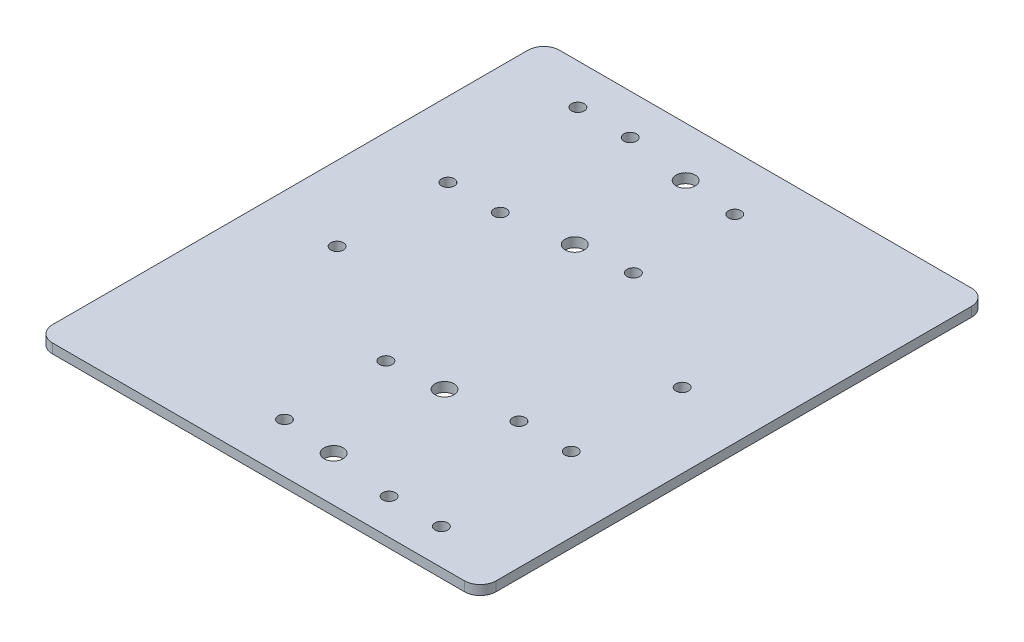
ISO-10303-21;
HEADER;
FILE_DESCRIPTION(('STEP AP214'),'2;1');
FILE_NAME('part.step','',(''),(''),'','','');
FILE_SCHEMA(('AUTOMOTIVE_DESIGN { 1 0 10303 214 1 1 1 1 }'));
ENDSEC;
DATA;
#1=APPLICATION_CONTEXT('core data for automotive mechanical design processes');
#2=APPLICATION_PROTOCOL_DEFINITION('international standard','automotive_design',2000,#1);
#3=PRODUCT_CONTEXT('',#1,'mechanical');
#4=PRODUCT('Part','Part','',(#3));
#5=PRODUCT_RELATED_PRODUCT_CATEGORY('part','',(#4));
#6=PRODUCT_DEFINITION_FORMATION('','',#4);
#7=PRODUCT_DEFINITION_CONTEXT('part definition',#1,'design');
#8=PRODUCT_DEFINITION('design','',#6,#7);
#9=PRODUCT_DEFINITION_SHAPE('','',#8);
#10=(LENGTH_UNIT() NAMED_UNIT(*) SI_UNIT(.MILLI.,.METRE.));
#11=(NAMED_UNIT(*) PLANE_ANGLE_UNIT() SI_UNIT($,.RADIAN.));
#12=(NAMED_UNIT(*) SI_UNIT($,.STERADIAN.) SOLID_ANGLE_UNIT());
#13=UNCERTAINTY_MEASURE_WITH_UNIT(LENGTH_MEASURE(1.E-05),#10,'distance_accuracy_value','');
#14=(GEOMETRIC_REPRESENTATION_CONTEXT(3) GLOBAL_UNCERTAINTY_ASSIGNED_CONTEXT((#13)) GLOBAL_UNIT_ASSIGNED_CONTEXT((#10,
#11,#12)) REPRESENTATION_CONTEXT('',''));
#15=CARTESIAN_POINT('',(0.,0.,0.));
#16=DIRECTION('',(0.,0.,1.));
#17=DIRECTION('',(1.,0.,0.));
#18=AXIS2_PLACEMENT_3D('',#15,#16,#17);
#19=CARTESIAN_POINT('',(-70.,3.,80.));
#20=DIRECTION('',(1.,0.,0.));
#21=DIRECTION('',(0.,0.,-1.));
#22=AXIS2_PLACEMENT_3D('',#19,#20,#21);
#23=PLANE('',#22);
#24=DIRECTION('',(0.,0.,1.));
#25=VECTOR('',#24,1.);
#26=CARTESIAN_POINT('',(-70.,3.,80.));
#27=LINE('',#26,#25);
#28=CARTESIAN_POINT('',(-70.,3.,-75.));
#29=VERTEX_POINT('',#28);
#30=CARTESIAN_POINT('',(-70.,3.,75.));
#31=VERTEX_POINT('',#30);
#32=EDGE_CURVE('E122',#29,#31,#27,.T.);
#33=ORIENTED_EDGE('',*,*,#32,.F.);
#34=DIRECTION('',(0.,-1.,0.));
#35=VECTOR('',#34,1.);
#36=CARTESIAN_POINT('',(-70.,3.,-75.));
#37=LINE('',#36,#35);
#38=CARTESIAN_POINT('',(-70.,0.,-75.));
#39=VERTEX_POINT('',#38);
#40=EDGE_CURVE('E107',#29,#39,#37,.T.);
#41=ORIENTED_EDGE('',*,*,#40,.T.);
#42=DIRECTION('',(0.,0.,1.));
#43=VECTOR('',#42,1.);
#44=CARTESIAN_POINT('',(-70.,0.,80.));
#45=LINE('',#44,#43);
#46=CARTESIAN_POINT('',(-70.,0.,75.));
#47=VERTEX_POINT('',#46);
#48=EDGE_CURVE('E119',#39,#47,#45,.T.);
#49=ORIENTED_EDGE('',*,*,#48,.T.);
#50=DIRECTION('',(0.,-1.,0.));
#51=VECTOR('',#50,1.);
#52=CARTESIAN_POINT('',(-70.,3.,75.));
#53=LINE('',#52,#51);
#54=EDGE_CURVE('E124',#47,#31,#53,.F.);
#55=ORIENTED_EDGE('',*,*,#54,.T.);
#56=EDGE_LOOP('',(#33,#41,#49,#55));
#57=FACE_BOUND('',#56,.T.);
#58=ADVANCED_FACE('F37',(#57),#23,.F.);
#59=CARTESIAN_POINT('',(70.,3.,80.));
#60=DIRECTION('',(0.,0.,-1.));
#61=DIRECTION('',(-1.,0.,0.));
#62=AXIS2_PLACEMENT_3D('',#59,#60,#61);
#63=PLANE('',#62);
#64=DIRECTION('',(1.,0.,0.));
#65=VECTOR('',#64,1.);
#66=CARTESIAN_POINT('',(70.,0.,80.));
#67=LINE('',#66,#65);
#68=CARTESIAN_POINT('',(-65.,0.,80.));
#69=VERTEX_POINT('',#68);
#70=CARTESIAN_POINT('',(65.,0.,80.));
#71=VERTEX_POINT('',#70);
#72=EDGE_CURVE('E128',#69,#71,#67,.T.);
#73=ORIENTED_EDGE('',*,*,#72,.T.);
#74=DIRECTION('',(0.,-1.,0.));
#75=VECTOR('',#74,1.);
#76=CARTESIAN_POINT('',(65.,3.,80.));
#77=LINE('',#76,#75);
#78=CARTESIAN_POINT('',(65.,3.,80.));
#79=VERTEX_POINT('',#78);
#80=EDGE_CURVE('E11',#71,#79,#77,.F.);
#81=ORIENTED_EDGE('',*,*,#80,.T.);
#82=DIRECTION('',(1.,0.,0.));
#83=VECTOR('',#82,1.);
#84=CARTESIAN_POINT('',(70.,3.,80.));
#85=LINE('',#84,#83);
#86=CARTESIAN_POINT('',(-65.,3.,80.));
#87=VERTEX_POINT('',#86);
#88=EDGE_CURVE('E168',#87,#79,#85,.T.);
#89=ORIENTED_EDGE('',*,*,#88,.F.);
#90=DIRECTION('',(0.,-1.,0.));
#91=VECTOR('',#90,1.);
#92=CARTESIAN_POINT('',(-65.,3.,80.));
#93=LINE('',#92,#91);
#94=EDGE_CURVE('E45',#87,#69,#93,.T.);
#95=ORIENTED_EDGE('',*,*,#94,.T.);
#96=EDGE_LOOP('',(#73,#81,#89,#95));
#97=FACE_BOUND('',#96,.T.);
#98=ADVANCED_FACE('F166',(#97),#63,.F.);
#99=CARTESIAN_POINT('',(70.,3.,80.));
#100=DIRECTION('',(-1.,0.,0.));
#101=DIRECTION('',(0.,0.,1.));
#102=AXIS2_PLACEMENT_3D('',#99,#100,#101);
#103=PLANE('',#102);
#104=DIRECTION('',(0.,0.,-1.));
#105=VECTOR('',#104,1.);
#106=CARTESIAN_POINT('',(70.,0.,80.));
#107=LINE('',#106,#105);
#108=CARTESIAN_POINT('',(70.,0.,75.));
#109=VERTEX_POINT('',#108);
#110=CARTESIAN_POINT('',(70.,0.,-75.));
#111=VERTEX_POINT('',#110);
#112=EDGE_CURVE('E132',#109,#111,#107,.T.);
#113=ORIENTED_EDGE('',*,*,#112,.T.);
#114=DIRECTION('',(0.,-1.,0.));
#115=VECTOR('',#114,1.);
#116=CARTESIAN_POINT('',(70.,3.,-75.));
#117=LINE('',#116,#115);
#118=CARTESIAN_POINT('',(70.,3.,-75.));
#119=VERTEX_POINT('',#118);
#120=EDGE_CURVE('E52',#111,#119,#117,.F.);
#121=ORIENTED_EDGE('',*,*,#120,.T.);
#122=DIRECTION('',(0.,0.,-1.));
#123=VECTOR('',#122,1.);
#124=CARTESIAN_POINT('',(70.,3.,80.));
#125=LINE('',#124,#123);
#126=CARTESIAN_POINT('',(70.,3.,75.));
#127=VERTEX_POINT('',#126);
#128=EDGE_CURVE('E176',#127,#119,#125,.T.);
#129=ORIENTED_EDGE('',*,*,#128,.F.);
#130=DIRECTION('',(0.,-1.,0.));
#131=VECTOR('',#130,1.);
#132=CARTESIAN_POINT('',(70.,3.,75.));
#133=LINE('',#132,#131);
#134=EDGE_CURVE('E159',#127,#109,#133,.T.);
#135=ORIENTED_EDGE('',*,*,#134,.T.);
#136=EDGE_LOOP('',(#113,#121,#129,#135));
#137=FACE_BOUND('',#136,.T.);
#138=ADVANCED_FACE('F175',(#137),#103,.F.);
#139=CARTESIAN_POINT('',(70.,3.,-80.));
#140=DIRECTION('',(0.,0.,1.));
#141=DIRECTION('',(1.,0.,0.));
#142=AXIS2_PLACEMENT_3D('',#139,#140,#141);
#143=PLANE('',#142);
#144=DIRECTION('',(-1.,0.,0.));
#145=VECTOR('',#144,1.);
#146=CARTESIAN_POINT('',(70.,0.,-80.));
#147=LINE('',#146,#145);
#148=CARTESIAN_POINT('',(65.,0.,-80.));
#149=VERTEX_POINT('',#148);
#150=CARTESIAN_POINT('',(-65.,0.,-80.));
#151=VERTEX_POINT('',#150);
#152=EDGE_CURVE('E142',#149,#151,#147,.T.);
#153=ORIENTED_EDGE('',*,*,#152,.T.);
#154=DIRECTION('',(0.,-1.,0.));
#155=VECTOR('',#154,1.);
#156=CARTESIAN_POINT('',(-65.,3.,-80.));
#157=LINE('',#156,#155);
#158=CARTESIAN_POINT('',(-65.,3.,-80.));
#159=VERTEX_POINT('',#158);
#160=EDGE_CURVE('E108',#151,#159,#157,.F.);
#161=ORIENTED_EDGE('',*,*,#160,.T.);
#162=DIRECTION('',(-1.,0.,0.));
#163=VECTOR('',#162,1.);
#164=CARTESIAN_POINT('',(70.,3.,-80.));
#165=LINE('',#164,#163);
#166=CARTESIAN_POINT('',(65.,3.,-80.));
#167=VERTEX_POINT('',#166);
#168=EDGE_CURVE('E138',#167,#159,#165,.T.);
#169=ORIENTED_EDGE('',*,*,#168,.F.);
#170=DIRECTION('',(0.,-1.,0.));
#171=VECTOR('',#170,1.);
#172=CARTESIAN_POINT('',(65.,3.,-80.));
#173=LINE('',#172,#171);
#174=EDGE_CURVE('E113',#167,#149,#173,.T.);
#175=ORIENTED_EDGE('',*,*,#174,.T.);
#176=EDGE_LOOP('',(#153,#161,#169,#175));
#177=FACE_BOUND('',#176,.T.);
#178=ADVANCED_FACE('F300',(#177),#143,.F.);
#179=CARTESIAN_POINT('',(0.,3.,0.));
#180=DIRECTION('',(0.,1.,0.));
#181=DIRECTION('',(0.,0.,1.));
#182=AXIS2_PLACEMENT_3D('',#179,#180,#181);
#183=PLANE('',#182);
#184=CARTESIAN_POINT('',(-46.5,3.,8.70000000000001));
#185=DIRECTION('',(0.,1.,0.));
#186=DIRECTION('',(0.,0.,1.));
#187=AXIS2_PLACEMENT_3D('',#184,#185,#186);
#188=CIRCLE('',#187,2.);
#189=CARTESIAN_POINT('',(-46.5,3.,10.7));
#190=VERTEX_POINT('',#189);
#191=EDGE_CURVE('E245',#190,#190,#188,.T.);
#192=ORIENTED_EDGE('',*,*,#191,.F.);
#193=EDGE_LOOP('',(#192));
#194=FACE_BOUND('',#193,.T.);
#195=CARTESIAN_POINT('',(-46.5,3.,-67.3));
#196=DIRECTION('',(0.,1.,0.));
#197=DIRECTION('',(0.,0.,1.));
#198=AXIS2_PLACEMENT_3D('',#195,#196,#197);
#199=CIRCLE('',#198,2.);
#200=CARTESIAN_POINT('',(-46.5,3.,-65.3));
#201=VERTEX_POINT('',#200);
#202=EDGE_CURVE('E252',#201,#201,#199,.T.);
#203=ORIENTED_EDGE('',*,*,#202,.F.);
#204=EDGE_LOOP('',(#203));
#205=FACE_BOUND('',#204,.T.);
#206=CARTESIAN_POINT('',(-46.5,3.,-26.3));
#207=DIRECTION('',(0.,1.,0.));
#208=DIRECTION('',(0.,0.,1.));
#209=AXIS2_PLACEMENT_3D('',#206,#207,#208);
#210=CIRCLE('',#209,2.);
#211=CARTESIAN_POINT('',(-46.5,3.,-24.3));
#212=VERTEX_POINT('',#211);
#213=EDGE_CURVE('E233',#212,#212,#210,.T.);
#214=ORIENTED_EDGE('',*,*,#213,.F.);
#215=EDGE_LOOP('',(#214));
#216=FACE_BOUND('',#215,.T.);
#217=CARTESIAN_POINT('',(46.5,3.,27.8));
#218=DIRECTION('',(0.,1.,0.));
#219=DIRECTION('',(0.,0.,1.));
#220=AXIS2_PLACEMENT_3D('',#217,#218,#219);
#221=CIRCLE('',#220,2.);
#222=CARTESIAN_POINT('',(46.5,3.,29.8));
#223=VERTEX_POINT('',#222);
#224=EDGE_CURVE('E240',#223,#223,#221,.T.);
#225=ORIENTED_EDGE('',*,*,#224,.F.);
#226=EDGE_LOOP('',(#225));
#227=FACE_BOUND('',#226,.T.);
#228=CARTESIAN_POINT('',(9.49999999999999,3.,65.8));
#229=DIRECTION('',(0.,1.,0.));
#230=DIRECTION('',(0.,0.,1.));
#231=AXIS2_PLACEMENT_3D('',#228,#229,#230);
#232=CIRCLE('',#231,3.);
#233=CARTESIAN_POINT('',(9.49999999999999,3.,68.8));
#234=VERTEX_POINT('',#233);
#235=EDGE_CURVE('E276',#234,#234,#232,.T.);
#236=ORIENTED_EDGE('',*,*,#235,.F.);
#237=EDGE_LOOP('',(#236));
#238=FACE_BOUND('',#237,.T.);
#239=CARTESIAN_POINT('',(9.49999999999999,3.,30.8));
#240=DIRECTION('',(0.,1.,0.));
#241=DIRECTION('',(0.,0.,1.));
#242=AXIS2_PLACEMENT_3D('',#239,#240,#241);
#243=CIRCLE('',#242,3.);
#244=CARTESIAN_POINT('',(9.49999999999999,3.,33.8));
#245=VERTEX_POINT('',#244);
#246=EDGE_CURVE('E270',#245,#245,#243,.T.);
#247=ORIENTED_EDGE('',*,*,#246,.F.);
#248=EDGE_LOOP('',(#247));
#249=FACE_BOUND('',#248,.T.);
#250=CARTESIAN_POINT('',(46.5,3.,-7.2));
#251=DIRECTION('',(0.,1.,0.));
#252=DIRECTION('',(0.,0.,1.));
#253=AXIS2_PLACEMENT_3D('',#250,#251,#252);
#254=CIRCLE('',#253,2.);
#255=CARTESIAN_POINT('',(46.5,3.,-5.2));
#256=VERTEX_POINT('',#255);
#257=EDGE_CURVE('E264',#256,#256,#254,.T.);
#258=ORIENTED_EDGE('',*,*,#257,.F.);
#259=EDGE_LOOP('',(#258));
#260=FACE_BOUND('',#259,.T.);
#261=CARTESIAN_POINT('',(-9.50000000000002,3.,-64.3));
#262=DIRECTION('',(0.,1.,0.));
#263=DIRECTION('',(0.,0.,1.));
#264=AXIS2_PLACEMENT_3D('',#261,#262,#263);
#265=CIRCLE('',#264,3.);
#266=CARTESIAN_POINT('',(-9.50000000000002,3.,-61.3));
#267=VERTEX_POINT('',#266);
#268=EDGE_CURVE('E257',#267,#267,#265,.T.);
#269=ORIENTED_EDGE('',*,*,#268,.F.);
#270=EDGE_LOOP('',(#269));
#271=FACE_BOUND('',#270,.T.);
#272=CARTESIAN_POINT('',(-30.,3.,-67.3));
#273=DIRECTION('',(0.,1.,0.));
#274=DIRECTION('',(0.,0.,1.));
#275=AXIS2_PLACEMENT_3D('',#272,#273,#274);
#276=CIRCLE('',#275,2.);
#277=CARTESIAN_POINT('',(-30.,3.,-65.3));
#278=VERTEX_POINT('',#277);
#279=EDGE_CURVE('E204',#278,#278,#276,.T.);
#280=ORIENTED_EDGE('',*,*,#279,.F.);
#281=EDGE_LOOP('',(#280));
#282=FACE_BOUND('',#281,.T.);
#283=CARTESIAN_POINT('',(7.49999999999998,3.,-62.8));
#284=DIRECTION('',(0.,1.,0.));
#285=DIRECTION('',(0.,0.,1.));
#286=AXIS2_PLACEMENT_3D('',#283,#284,#285);
#287=CIRCLE('',#286,2.);
#288=CARTESIAN_POINT('',(7.49999999999998,3.,-60.8));
#289=VERTEX_POINT('',#288);
#290=EDGE_CURVE('E198',#289,#289,#287,.T.);
#291=ORIENTED_EDGE('',*,*,#290,.F.);
#292=EDGE_LOOP('',(#291));
#293=FACE_BOUND('',#292,.T.);
#294=CARTESIAN_POINT('',(7.49999999999998,3.,-30.8));
#295=DIRECTION('',(0.,1.,0.));
#296=DIRECTION('',(0.,0.,1.));
#297=AXIS2_PLACEMENT_3D('',#294,#295,#296);
#298=CIRCLE('',#297,2.);
#299=CARTESIAN_POINT('',(7.49999999999998,3.,-28.8));
#300=VERTEX_POINT('',#299);
#301=EDGE_CURVE('E192',#300,#300,#298,.T.);
#302=ORIENTED_EDGE('',*,*,#301,.F.);
#303=EDGE_LOOP('',(#302));
#304=FACE_BOUND('',#303,.T.);
#305=CARTESIAN_POINT('',(30.,3.,68.8));
#306=DIRECTION('',(0.,1.,0.));
#307=DIRECTION('',(0.,0.,1.));
#308=AXIS2_PLACEMENT_3D('',#305,#306,#307);
#309=CIRCLE('',#308,2.00000000000001);
#310=CARTESIAN_POINT('',(30.,3.,70.8));
#311=VERTEX_POINT('',#310);
#312=EDGE_CURVE('E185',#311,#311,#309,.T.);
#313=ORIENTED_EDGE('',*,*,#312,.F.);
#314=EDGE_LOOP('',(#313));
#315=FACE_BOUND('',#314,.T.);
#316=CARTESIAN_POINT('',(46.5,3.,68.8));
#317=DIRECTION('',(0.,1.,0.));
#318=DIRECTION('',(0.,0.,1.));
#319=AXIS2_PLACEMENT_3D('',#316,#317,#318);
#320=CIRCLE('',#319,2.);
#321=CARTESIAN_POINT('',(46.5,3.,70.8));
#322=VERTEX_POINT('',#321);
#323=EDGE_CURVE('E221',#322,#322,#320,.T.);
#324=ORIENTED_EDGE('',*,*,#323,.F.);
#325=EDGE_LOOP('',(#324));
#326=FACE_BOUND('',#325,.T.);
#327=CARTESIAN_POINT('',(-7.50000000000001,3.,32.3));
#328=DIRECTION('',(0.,1.,0.));
#329=DIRECTION('',(0.,0.,1.));
#330=AXIS2_PLACEMENT_3D('',#327,#328,#329);
#331=CIRCLE('',#330,2.00000000000001);
#332=CARTESIAN_POINT('',(-7.50000000000001,3.,34.3));
#333=VERTEX_POINT('',#332);
#334=EDGE_CURVE('E228',#333,#333,#331,.T.);
#335=ORIENTED_EDGE('',*,*,#334,.F.);
#336=EDGE_LOOP('',(#335));
#337=FACE_BOUND('',#336,.T.);
#338=CARTESIAN_POINT('',(30.,3.,27.8));
#339=DIRECTION('',(0.,1.,0.));
#340=DIRECTION('',(0.,0.,1.));
#341=AXIS2_PLACEMENT_3D('',#338,#339,#340);
#342=CIRCLE('',#341,2.00000000000001);
#343=CARTESIAN_POINT('',(30.,3.,29.8));
#344=VERTEX_POINT('',#343);
#345=EDGE_CURVE('E209',#344,#344,#342,.T.);
#346=ORIENTED_EDGE('',*,*,#345,.F.);
#347=EDGE_LOOP('',(#346));
#348=FACE_BOUND('',#347,.T.);
#349=CARTESIAN_POINT('',(-7.50000000000001,3.,64.3));
#350=DIRECTION('',(0.,1.,0.));
#351=DIRECTION('',(0.,0.,1.));
#352=AXIS2_PLACEMENT_3D('',#349,#350,#351);
#353=CIRCLE('',#352,2.00000000000001);
#354=CARTESIAN_POINT('',(-7.50000000000001,3.,66.3));
#355=VERTEX_POINT('',#354);
#356=EDGE_CURVE('E216',#355,#355,#353,.T.);
#357=ORIENTED_EDGE('',*,*,#356,.F.);
#358=EDGE_LOOP('',(#357));
#359=FACE_BOUND('',#358,.T.);
#360=CARTESIAN_POINT('',(-9.50000000000002,3.,-29.3));
#361=DIRECTION('',(0.,1.,0.));
#362=DIRECTION('',(0.,0.,1.));
#363=AXIS2_PLACEMENT_3D('',#360,#361,#362);
#364=CIRCLE('',#363,3.);
#365=CARTESIAN_POINT('',(-9.50000000000002,3.,-26.3));
#366=VERTEX_POINT('',#365);
#367=EDGE_CURVE('E281',#366,#366,#364,.T.);
#368=ORIENTED_EDGE('',*,*,#367,.F.);
#369=EDGE_LOOP('',(#368));
#370=FACE_BOUND('',#369,.T.);
#371=CARTESIAN_POINT('',(-30.,3.,-26.3));
#372=DIRECTION('',(0.,1.,0.));
#373=DIRECTION('',(0.,0.,1.));
#374=AXIS2_PLACEMENT_3D('',#371,#372,#373);
#375=CIRCLE('',#374,2.);
#376=CARTESIAN_POINT('',(-30.,3.,-24.3));
#377=VERTEX_POINT('',#376);
#378=EDGE_CURVE('E135',#377,#377,#375,.T.);
#379=ORIENTED_EDGE('',*,*,#378,.F.);
#380=EDGE_LOOP('',(#379));
#381=FACE_BOUND('',#380,.T.);
#382=ORIENTED_EDGE('',*,*,#168,.T.);
#383=CARTESIAN_POINT('',(-65.,3.,-75.));
#384=DIRECTION('',(0.,1.,0.));
#385=DIRECTION('',(0.,0.,1.));
#386=AXIS2_PLACEMENT_3D('',#383,#384,#385);
#387=CIRCLE('',#386,5.);
#388=EDGE_CURVE('E157',#159,#29,#387,.T.);
#389=ORIENTED_EDGE('',*,*,#388,.T.);
#390=ORIENTED_EDGE('',*,*,#32,.T.);
#391=CARTESIAN_POINT('',(-65.,3.,75.));
#392=DIRECTION('',(0.,1.,0.));
#393=DIRECTION('',(0.,0.,1.));
#394=AXIS2_PLACEMENT_3D('',#391,#392,#393);
#395=CIRCLE('',#394,5.);
#396=EDGE_CURVE('E152',#31,#87,#395,.T.);
#397=ORIENTED_EDGE('',*,*,#396,.T.);
#398=ORIENTED_EDGE('',*,*,#88,.T.);
#399=CARTESIAN_POINT('',(65.,3.,75.));
#400=DIRECTION('',(0.,1.,0.));
#401=DIRECTION('',(0.,0.,1.));
#402=AXIS2_PLACEMENT_3D('',#399,#400,#401);
#403=CIRCLE('',#402,5.);
#404=EDGE_CURVE('E59',#79,#127,#403,.T.);
#405=ORIENTED_EDGE('',*,*,#404,.T.);
#406=ORIENTED_EDGE('',*,*,#128,.T.);
#407=CARTESIAN_POINT('',(65.,3.,-75.));
#408=DIRECTION('',(0.,1.,0.));
#409=DIRECTION('',(0.,0.,1.));
#410=AXIS2_PLACEMENT_3D('',#407,#408,#409);
#411=CIRCLE('',#410,5.);
#412=EDGE_CURVE('E155',#119,#167,#411,.T.);
#413=ORIENTED_EDGE('',*,*,#412,.T.);
#414=EDGE_LOOP('',(#382,#389,#390,#397,#398,#405,#406,#413));
#415=FACE_BOUND('',#414,.T.);
#416=ADVANCED_FACE('F297',(#194,#205,#216,#227,#238,#249,#260,#271,#282,#293,#304,#315,#326,
#337,#348,#359,#370,#381,#415),#183,.T.);
#417=CARTESIAN_POINT('',(0.,0.,0.));
#418=DIRECTION('',(0.,1.,0.));
#419=DIRECTION('',(0.,0.,1.));
#420=AXIS2_PLACEMENT_3D('',#417,#418,#419);
#421=PLANE('',#420);
#422=CARTESIAN_POINT('',(-46.5,0.,8.70000000000001));
#423=DIRECTION('',(0.,1.,0.));
#424=DIRECTION('',(0.,0.,1.));
#425=AXIS2_PLACEMENT_3D('',#422,#423,#424);
#426=CIRCLE('',#425,2.);
#427=CARTESIAN_POINT('',(-46.5,0.,10.7));
#428=VERTEX_POINT('',#427);
#429=EDGE_CURVE('E248',#428,#428,#426,.T.);
#430=ORIENTED_EDGE('',*,*,#429,.T.);
#431=EDGE_LOOP('',(#430));
#432=FACE_BOUND('',#431,.T.);
#433=CARTESIAN_POINT('',(-46.5,0.,-67.3));
#434=DIRECTION('',(0.,1.,0.));
#435=DIRECTION('',(0.,0.,1.));
#436=AXIS2_PLACEMENT_3D('',#433,#434,#435);
#437=CIRCLE('',#436,2.);
#438=CARTESIAN_POINT('',(-46.5,0.,-65.3));
#439=VERTEX_POINT('',#438);
#440=EDGE_CURVE('E237',#439,#439,#437,.T.);
#441=ORIENTED_EDGE('',*,*,#440,.T.);
#442=EDGE_LOOP('',(#441));
#443=FACE_BOUND('',#442,.T.);
#444=CARTESIAN_POINT('',(-46.5,0.,-26.3));
#445=DIRECTION('',(0.,1.,0.));
#446=DIRECTION('',(0.,0.,1.));
#447=AXIS2_PLACEMENT_3D('',#444,#445,#446);
#448=CIRCLE('',#447,2.);
#449=CARTESIAN_POINT('',(-46.5,0.,-24.3));
#450=VERTEX_POINT('',#449);
#451=EDGE_CURVE('E236',#450,#450,#448,.T.);
#452=ORIENTED_EDGE('',*,*,#451,.T.);
#453=EDGE_LOOP('',(#452));
#454=FACE_BOUND('',#453,.T.);
#455=CARTESIAN_POINT('',(46.5,0.,27.8));
#456=DIRECTION('',(0.,1.,0.));
#457=DIRECTION('',(0.,0.,1.));
#458=AXIS2_PLACEMENT_3D('',#455,#456,#457);
#459=CIRCLE('',#458,2.);
#460=CARTESIAN_POINT('',(46.5,0.,29.8));
#461=VERTEX_POINT('',#460);
#462=EDGE_CURVE('E225',#461,#461,#459,.T.);
#463=ORIENTED_EDGE('',*,*,#462,.T.);
#464=EDGE_LOOP('',(#463));
#465=FACE_BOUND('',#464,.T.);
#466=CARTESIAN_POINT('',(9.49999999999999,0.,65.8));
#467=DIRECTION('',(0.,1.,0.));
#468=DIRECTION('',(0.,0.,1.));
#469=AXIS2_PLACEMENT_3D('',#466,#467,#468);
#470=CIRCLE('',#469,3.);
#471=CARTESIAN_POINT('',(9.49999999999999,0.,68.8));
#472=VERTEX_POINT('',#471);
#473=EDGE_CURVE('E249',#472,#472,#470,.T.);
#474=ORIENTED_EDGE('',*,*,#473,.T.);
#475=EDGE_LOOP('',(#474));
#476=FACE_BOUND('',#475,.T.);
#477=CARTESIAN_POINT('',(9.49999999999999,0.,30.8));
#478=DIRECTION('',(0.,1.,0.));
#479=DIRECTION('',(0.,0.,1.));
#480=AXIS2_PLACEMENT_3D('',#477,#478,#479);
#481=CIRCLE('',#480,3.);
#482=CARTESIAN_POINT('',(9.49999999999999,0.,33.8));
#483=VERTEX_POINT('',#482);
#484=EDGE_CURVE('E273',#483,#483,#481,.T.);
#485=ORIENTED_EDGE('',*,*,#484,.T.);
#486=EDGE_LOOP('',(#485));
#487=FACE_BOUND('',#486,.T.);
#488=CARTESIAN_POINT('',(46.5,0.,-7.2));
#489=DIRECTION('',(0.,1.,0.));
#490=DIRECTION('',(0.,0.,1.));
#491=AXIS2_PLACEMENT_3D('',#488,#489,#490);
#492=CIRCLE('',#491,2.);
#493=CARTESIAN_POINT('',(46.5,0.,-5.2));
#494=VERTEX_POINT('',#493);
#495=EDGE_CURVE('E267',#494,#494,#492,.T.);
#496=ORIENTED_EDGE('',*,*,#495,.T.);
#497=EDGE_LOOP('',(#496));
#498=FACE_BOUND('',#497,.T.);
#499=CARTESIAN_POINT('',(-9.50000000000002,0.,-64.3));
#500=DIRECTION('',(0.,1.,0.));
#501=DIRECTION('',(0.,0.,1.));
#502=AXIS2_PLACEMENT_3D('',#499,#500,#501);
#503=CIRCLE('',#502,3.);
#504=CARTESIAN_POINT('',(-9.50000000000002,0.,-61.3));
#505=VERTEX_POINT('',#504);
#506=EDGE_CURVE('E260',#505,#505,#503,.T.);
#507=ORIENTED_EDGE('',*,*,#506,.T.);
#508=EDGE_LOOP('',(#507));
#509=FACE_BOUND('',#508,.T.);
#510=CARTESIAN_POINT('',(-30.,0.,-67.3));
#511=DIRECTION('',(0.,1.,0.));
#512=DIRECTION('',(0.,0.,1.));
#513=AXIS2_PLACEMENT_3D('',#510,#511,#512);
#514=CIRCLE('',#513,2.);
#515=CARTESIAN_POINT('',(-30.,0.,-65.3));
#516=VERTEX_POINT('',#515);
#517=EDGE_CURVE('E183',#516,#516,#514,.T.);
#518=ORIENTED_EDGE('',*,*,#517,.T.);
#519=EDGE_LOOP('',(#518));
#520=FACE_BOUND('',#519,.T.);
#521=CARTESIAN_POINT('',(7.49999999999998,0.,-62.8));
#522=DIRECTION('',(0.,1.,0.));
#523=DIRECTION('',(0.,0.,1.));
#524=AXIS2_PLACEMENT_3D('',#521,#522,#523);
#525=CIRCLE('',#524,2.);
#526=CARTESIAN_POINT('',(7.49999999999998,0.,-60.8));
#527=VERTEX_POINT('',#526);
#528=EDGE_CURVE('E201',#527,#527,#525,.T.);
#529=ORIENTED_EDGE('',*,*,#528,.T.);
#530=EDGE_LOOP('',(#529));
#531=FACE_BOUND('',#530,.T.);
#532=CARTESIAN_POINT('',(7.49999999999998,0.,-30.8));
#533=DIRECTION('',(0.,1.,0.));
#534=DIRECTION('',(0.,0.,1.));
#535=AXIS2_PLACEMENT_3D('',#532,#533,#534);
#536=CIRCLE('',#535,2.);
#537=CARTESIAN_POINT('',(7.49999999999998,0.,-28.8));
#538=VERTEX_POINT('',#537);
#539=EDGE_CURVE('E195',#538,#538,#536,.T.);
#540=ORIENTED_EDGE('',*,*,#539,.T.);
#541=EDGE_LOOP('',(#540));
#542=FACE_BOUND('',#541,.T.);
#543=CARTESIAN_POINT('',(30.,0.,68.8));
#544=DIRECTION('',(0.,1.,0.));
#545=DIRECTION('',(0.,0.,1.));
#546=AXIS2_PLACEMENT_3D('',#543,#544,#545);
#547=CIRCLE('',#546,2.00000000000001);
#548=CARTESIAN_POINT('',(30.,0.,70.8));
#549=VERTEX_POINT('',#548);
#550=EDGE_CURVE('E188',#549,#549,#547,.T.);
#551=ORIENTED_EDGE('',*,*,#550,.T.);
#552=EDGE_LOOP('',(#551));
#553=FACE_BOUND('',#552,.T.);
#554=CARTESIAN_POINT('',(46.5,0.,68.8));
#555=DIRECTION('',(0.,1.,0.));
#556=DIRECTION('',(0.,0.,1.));
#557=AXIS2_PLACEMENT_3D('',#554,#555,#556);
#558=CIRCLE('',#557,2.);
#559=CARTESIAN_POINT('',(46.5,0.,70.8));
#560=VERTEX_POINT('',#559);
#561=EDGE_CURVE('E224',#560,#560,#558,.T.);
#562=ORIENTED_EDGE('',*,*,#561,.T.);
#563=EDGE_LOOP('',(#562));
#564=FACE_BOUND('',#563,.T.);
#565=CARTESIAN_POINT('',(-7.50000000000001,0.,32.3));
#566=DIRECTION('',(0.,1.,0.));
#567=DIRECTION('',(0.,0.,1.));
#568=AXIS2_PLACEMENT_3D('',#565,#566,#567);
#569=CIRCLE('',#568,2.00000000000001);
#570=CARTESIAN_POINT('',(-7.50000000000001,0.,34.3));
#571=VERTEX_POINT('',#570);
#572=EDGE_CURVE('E213',#571,#571,#569,.T.);
#573=ORIENTED_EDGE('',*,*,#572,.T.);
#574=EDGE_LOOP('',(#573));
#575=FACE_BOUND('',#574,.T.);
#576=CARTESIAN_POINT('',(30.,0.,27.8));
#577=DIRECTION('',(0.,1.,0.));
#578=DIRECTION('',(0.,0.,1.));
#579=AXIS2_PLACEMENT_3D('',#576,#577,#578);
#580=CIRCLE('',#579,2.00000000000001);
#581=CARTESIAN_POINT('',(30.,0.,29.8));
#582=VERTEX_POINT('',#581);
#583=EDGE_CURVE('E212',#582,#582,#580,.T.);
#584=ORIENTED_EDGE('',*,*,#583,.T.);
#585=EDGE_LOOP('',(#584));
#586=FACE_BOUND('',#585,.T.);
#587=CARTESIAN_POINT('',(-7.50000000000001,0.,64.3));
#588=DIRECTION('',(0.,1.,0.));
#589=DIRECTION('',(0.,0.,1.));
#590=AXIS2_PLACEMENT_3D('',#587,#588,#589);
#591=CIRCLE('',#590,2.00000000000001);
#592=CARTESIAN_POINT('',(-7.50000000000001,0.,66.3));
#593=VERTEX_POINT('',#592);
#594=EDGE_CURVE('E189',#593,#593,#591,.T.);
#595=ORIENTED_EDGE('',*,*,#594,.T.);
#596=EDGE_LOOP('',(#595));
#597=FACE_BOUND('',#596,.T.);
#598=CARTESIAN_POINT('',(-9.50000000000002,0.,-29.3));
#599=DIRECTION('',(0.,1.,0.));
#600=DIRECTION('',(0.,0.,1.));
#601=AXIS2_PLACEMENT_3D('',#598,#599,#600);
#602=CIRCLE('',#601,3.);
#603=CARTESIAN_POINT('',(-9.50000000000002,0.,-26.3));
#604=VERTEX_POINT('',#603);
#605=EDGE_CURVE('E261',#604,#604,#602,.T.);
#606=ORIENTED_EDGE('',*,*,#605,.T.);
#607=EDGE_LOOP('',(#606));
#608=FACE_BOUND('',#607,.T.);
#609=CARTESIAN_POINT('',(-30.,0.,-26.3));
#610=DIRECTION('',(0.,1.,0.));
#611=DIRECTION('',(0.,0.,1.));
#612=AXIS2_PLACEMENT_3D('',#609,#610,#611);
#613=CIRCLE('',#612,2.);
#614=CARTESIAN_POINT('',(-30.,0.,-24.3));
#615=VERTEX_POINT('',#614);
#616=EDGE_CURVE('E129',#615,#615,#613,.T.);
#617=ORIENTED_EDGE('',*,*,#616,.T.);
#618=EDGE_LOOP('',(#617));
#619=FACE_BOUND('',#618,.T.);
#620=ORIENTED_EDGE('',*,*,#48,.F.);
#621=CARTESIAN_POINT('',(-65.,0.,-75.));
#622=DIRECTION('',(0.,1.,0.));
#623=DIRECTION('',(0.,0.,1.));
#624=AXIS2_PLACEMENT_3D('',#621,#622,#623);
#625=CIRCLE('',#624,5.);
#626=EDGE_CURVE('E103',#39,#151,#625,.F.);
#627=ORIENTED_EDGE('',*,*,#626,.T.);
#628=ORIENTED_EDGE('',*,*,#152,.F.);
#629=CARTESIAN_POINT('',(65.,0.,-75.));
#630=DIRECTION('',(0.,1.,0.));
#631=DIRECTION('',(0.,0.,1.));
#632=AXIS2_PLACEMENT_3D('',#629,#630,#631);
#633=CIRCLE('',#632,5.);
#634=EDGE_CURVE('E114',#149,#111,#633,.F.);
#635=ORIENTED_EDGE('',*,*,#634,.T.);
#636=ORIENTED_EDGE('',*,*,#112,.F.);
#637=CARTESIAN_POINT('',(65.,0.,75.));
#638=DIRECTION('',(0.,1.,0.));
#639=DIRECTION('',(0.,0.,1.));
#640=AXIS2_PLACEMENT_3D('',#637,#638,#639);
#641=CIRCLE('',#640,5.);
#642=EDGE_CURVE('E146',#109,#71,#641,.F.);
#643=ORIENTED_EDGE('',*,*,#642,.T.);
#644=ORIENTED_EDGE('',*,*,#72,.F.);
#645=CARTESIAN_POINT('',(-65.,0.,75.));
#646=DIRECTION('',(0.,1.,0.));
#647=DIRECTION('',(0.,0.,1.));
#648=AXIS2_PLACEMENT_3D('',#645,#646,#647);
#649=CIRCLE('',#648,5.);
#650=EDGE_CURVE('E123',#69,#47,#649,.F.);
#651=ORIENTED_EDGE('',*,*,#650,.T.);
#652=EDGE_LOOP('',(#620,#627,#628,#635,#636,#643,#644,#651));
#653=FACE_BOUND('',#652,.T.);
#654=ADVANCED_FACE('F126',(#432,#443,#454,#465,#476,#487,#498,#509,#520,#531,#542,#553,#564,
#575,#586,#597,#608,#619,#653),#421,.F.);
#655=CARTESIAN_POINT('',(-30.,0.,-26.3));
#656=DIRECTION('',(0.,1.,0.));
#657=DIRECTION('',(0.,0.,1.));
#658=AXIS2_PLACEMENT_3D('',#655,#656,#657);
#659=CYLINDRICAL_SURFACE('',#658,2.);
#660=ORIENTED_EDGE('',*,*,#616,.F.);
#661=EDGE_LOOP('',(#660));
#662=FACE_BOUND('',#661,.T.);
#663=ORIENTED_EDGE('',*,*,#378,.T.);
#664=EDGE_LOOP('',(#663));
#665=FACE_BOUND('',#664,.T.);
#666=ADVANCED_FACE('F293',(#662,#665),#659,.F.);
#667=CARTESIAN_POINT('',(-9.50000000000002,0.,-29.3));
#668=DIRECTION('',(0.,1.,0.));
#669=DIRECTION('',(0.,0.,1.));
#670=AXIS2_PLACEMENT_3D('',#667,#668,#669);
#671=CYLINDRICAL_SURFACE('',#670,3.);
#672=ORIENTED_EDGE('',*,*,#605,.F.);
#673=EDGE_LOOP('',(#672));
#674=FACE_BOUND('',#673,.T.);
#675=ORIENTED_EDGE('',*,*,#367,.T.);
#676=EDGE_LOOP('',(#675));
#677=FACE_BOUND('',#676,.T.);
#678=ADVANCED_FACE('F289',(#674,#677),#671,.F.);
#679=CARTESIAN_POINT('',(-7.50000000000001,0.,64.3));
#680=DIRECTION('',(0.,1.,0.));
#681=DIRECTION('',(0.,0.,1.));
#682=AXIS2_PLACEMENT_3D('',#679,#680,#681);
#683=CYLINDRICAL_SURFACE('',#682,2.00000000000001);
#684=ORIENTED_EDGE('',*,*,#594,.F.);
#685=EDGE_LOOP('',(#684));
#686=FACE_BOUND('',#685,.T.);
#687=ORIENTED_EDGE('',*,*,#356,.T.);
#688=EDGE_LOOP('',(#687));
#689=FACE_BOUND('',#688,.T.);
#690=ADVANCED_FACE('F292',(#686,#689),#683,.F.);
#691=CARTESIAN_POINT('',(30.,0.,27.8));
#692=DIRECTION('',(0.,1.,0.));
#693=DIRECTION('',(0.,0.,1.));
#694=AXIS2_PLACEMENT_3D('',#691,#692,#693);
#695=CYLINDRICAL_SURFACE('',#694,2.00000000000001);
#696=ORIENTED_EDGE('',*,*,#583,.F.);
#697=EDGE_LOOP('',(#696));
#698=FACE_BOUND('',#697,.T.);
#699=ORIENTED_EDGE('',*,*,#345,.T.);
#700=EDGE_LOOP('',(#699));
#701=FACE_BOUND('',#700,.T.);
#702=ADVANCED_FACE('F352',(#698,#701),#695,.F.);
#703=CARTESIAN_POINT('',(-7.50000000000001,0.,32.3));
#704=DIRECTION('',(0.,1.,0.));
#705=DIRECTION('',(0.,0.,1.));
#706=AXIS2_PLACEMENT_3D('',#703,#704,#705);
#707=CYLINDRICAL_SURFACE('',#706,2.00000000000001);
#708=ORIENTED_EDGE('',*,*,#572,.F.);
#709=EDGE_LOOP('',(#708));
#710=FACE_BOUND('',#709,.T.);
#711=ORIENTED_EDGE('',*,*,#334,.T.);
#712=EDGE_LOOP('',(#711));
#713=FACE_BOUND('',#712,.T.);
#714=ADVANCED_FACE('F355',(#710,#713),#707,.F.);
#715=CARTESIAN_POINT('',(46.5,0.,68.8));
#716=DIRECTION('',(0.,1.,0.));
#717=DIRECTION('',(0.,0.,1.));
#718=AXIS2_PLACEMENT_3D('',#715,#716,#717);
#719=CYLINDRICAL_SURFACE('',#718,2.);
#720=ORIENTED_EDGE('',*,*,#561,.F.);
#721=EDGE_LOOP('',(#720));
#722=FACE_BOUND('',#721,.T.);
#723=ORIENTED_EDGE('',*,*,#323,.T.);
#724=EDGE_LOOP('',(#723));
#725=FACE_BOUND('',#724,.T.);
#726=ADVANCED_FACE('F338',(#722,#725),#719,.F.);
#727=CARTESIAN_POINT('',(30.,0.,68.8));
#728=DIRECTION('',(0.,1.,0.));
#729=DIRECTION('',(0.,0.,1.));
#730=AXIS2_PLACEMENT_3D('',#727,#728,#729);
#731=CYLINDRICAL_SURFACE('',#730,2.00000000000001);
#732=ORIENTED_EDGE('',*,*,#550,.F.);
#733=EDGE_LOOP('',(#732));
#734=FACE_BOUND('',#733,.T.);
#735=ORIENTED_EDGE('',*,*,#312,.T.);
#736=EDGE_LOOP('',(#735));
#737=FACE_BOUND('',#736,.T.);
#738=ADVANCED_FACE('F334',(#734,#737),#731,.F.);
#739=CARTESIAN_POINT('',(7.49999999999998,0.,-30.8));
#740=DIRECTION('',(0.,1.,0.));
#741=DIRECTION('',(0.,0.,1.));
#742=AXIS2_PLACEMENT_3D('',#739,#740,#741);
#743=CYLINDRICAL_SURFACE('',#742,2.);
#744=ORIENTED_EDGE('',*,*,#539,.F.);
#745=EDGE_LOOP('',(#744));
#746=FACE_BOUND('',#745,.T.);
#747=ORIENTED_EDGE('',*,*,#301,.T.);
#748=EDGE_LOOP('',(#747));
#749=FACE_BOUND('',#748,.T.);
#750=ADVANCED_FACE('F337',(#746,#749),#743,.F.);
#751=CARTESIAN_POINT('',(7.49999999999998,0.,-62.8));
#752=DIRECTION('',(0.,1.,0.));
#753=DIRECTION('',(0.,0.,1.));
#754=AXIS2_PLACEMENT_3D('',#751,#752,#753);
#755=CYLINDRICAL_SURFACE('',#754,2.);
#756=ORIENTED_EDGE('',*,*,#528,.F.);
#757=EDGE_LOOP('',(#756));
#758=FACE_BOUND('',#757,.T.);
#759=ORIENTED_EDGE('',*,*,#290,.T.);
#760=EDGE_LOOP('',(#759));
#761=FACE_BOUND('',#760,.T.);
#762=ADVANCED_FACE('F342',(#758,#761),#755,.F.);
#763=CARTESIAN_POINT('',(-30.,0.,-67.3));
#764=DIRECTION('',(0.,1.,0.));
#765=DIRECTION('',(0.,0.,1.));
#766=AXIS2_PLACEMENT_3D('',#763,#764,#765);
#767=CYLINDRICAL_SURFACE('',#766,2.);
#768=ORIENTED_EDGE('',*,*,#517,.F.);
#769=EDGE_LOOP('',(#768));
#770=FACE_BOUND('',#769,.T.);
#771=ORIENTED_EDGE('',*,*,#279,.T.);
#772=EDGE_LOOP('',(#771));
#773=FACE_BOUND('',#772,.T.);
#774=ADVANCED_FACE('F346',(#770,#773),#767,.F.);
#775=CARTESIAN_POINT('',(-9.50000000000002,0.,-64.3));
#776=DIRECTION('',(0.,1.,0.));
#777=DIRECTION('',(0.,0.,1.));
#778=AXIS2_PLACEMENT_3D('',#775,#776,#777);
#779=CYLINDRICAL_SURFACE('',#778,3.);
#780=ORIENTED_EDGE('',*,*,#506,.F.);
#781=EDGE_LOOP('',(#780));
#782=FACE_BOUND('',#781,.T.);
#783=ORIENTED_EDGE('',*,*,#268,.T.);
#784=EDGE_LOOP('',(#783));
#785=FACE_BOUND('',#784,.T.);
#786=ADVANCED_FACE('F350',(#782,#785),#779,.F.);
#787=CARTESIAN_POINT('',(46.5,0.,-7.2));
#788=DIRECTION('',(0.,1.,0.));
#789=DIRECTION('',(0.,0.,1.));
#790=AXIS2_PLACEMENT_3D('',#787,#788,#789);
#791=CYLINDRICAL_SURFACE('',#790,2.);
#792=ORIENTED_EDGE('',*,*,#495,.F.);
#793=EDGE_LOOP('',(#792));
#794=FACE_BOUND('',#793,.T.);
#795=ORIENTED_EDGE('',*,*,#257,.T.);
#796=EDGE_LOOP('',(#795));
#797=FACE_BOUND('',#796,.T.);
#798=ADVANCED_FACE('F384',(#794,#797),#791,.F.);
#799=CARTESIAN_POINT('',(9.49999999999999,0.,30.8));
#800=DIRECTION('',(0.,1.,0.));
#801=DIRECTION('',(0.,0.,1.));
#802=AXIS2_PLACEMENT_3D('',#799,#800,#801);
#803=CYLINDRICAL_SURFACE('',#802,3.);
#804=ORIENTED_EDGE('',*,*,#484,.F.);
#805=EDGE_LOOP('',(#804));
#806=FACE_BOUND('',#805,.T.);
#807=ORIENTED_EDGE('',*,*,#246,.T.);
#808=EDGE_LOOP('',(#807));
#809=FACE_BOUND('',#808,.T.);
#810=ADVANCED_FACE('F388',(#806,#809),#803,.F.);
#811=CARTESIAN_POINT('',(9.49999999999999,0.,65.8));
#812=DIRECTION('',(0.,1.,0.));
#813=DIRECTION('',(0.,0.,1.));
#814=AXIS2_PLACEMENT_3D('',#811,#812,#813);
#815=CYLINDRICAL_SURFACE('',#814,3.);
#816=ORIENTED_EDGE('',*,*,#473,.F.);
#817=EDGE_LOOP('',(#816));
#818=FACE_BOUND('',#817,.T.);
#819=ORIENTED_EDGE('',*,*,#235,.T.);
#820=EDGE_LOOP('',(#819));
#821=FACE_BOUND('',#820,.T.);
#822=ADVANCED_FACE('F374',(#818,#821),#815,.F.);
#823=CARTESIAN_POINT('',(46.5,0.,27.8));
#824=DIRECTION('',(0.,1.,0.));
#825=DIRECTION('',(0.,0.,1.));
#826=AXIS2_PLACEMENT_3D('',#823,#824,#825);
#827=CYLINDRICAL_SURFACE('',#826,2.);
#828=ORIENTED_EDGE('',*,*,#462,.F.);
#829=EDGE_LOOP('',(#828));
#830=FACE_BOUND('',#829,.T.);
#831=ORIENTED_EDGE('',*,*,#224,.T.);
#832=EDGE_LOOP('',(#831));
#833=FACE_BOUND('',#832,.T.);
#834=ADVANCED_FACE('F370',(#830,#833),#827,.F.);
#835=CARTESIAN_POINT('',(-46.5,0.,-26.3));
#836=DIRECTION('',(0.,1.,0.));
#837=DIRECTION('',(0.,0.,1.));
#838=AXIS2_PLACEMENT_3D('',#835,#836,#837);
#839=CYLINDRICAL_SURFACE('',#838,2.);
#840=ORIENTED_EDGE('',*,*,#451,.F.);
#841=EDGE_LOOP('',(#840));
#842=FACE_BOUND('',#841,.T.);
#843=ORIENTED_EDGE('',*,*,#213,.T.);
#844=EDGE_LOOP('',(#843));
#845=FACE_BOUND('',#844,.T.);
#846=ADVANCED_FACE('F366',(#842,#845),#839,.F.);
#847=CARTESIAN_POINT('',(-46.5,0.,-67.3));
#848=DIRECTION('',(0.,1.,0.));
#849=DIRECTION('',(0.,0.,1.));
#850=AXIS2_PLACEMENT_3D('',#847,#848,#849);
#851=CYLINDRICAL_SURFACE('',#850,2.);
#852=ORIENTED_EDGE('',*,*,#440,.F.);
#853=EDGE_LOOP('',(#852));
#854=FACE_BOUND('',#853,.T.);
#855=ORIENTED_EDGE('',*,*,#202,.T.);
#856=EDGE_LOOP('',(#855));
#857=FACE_BOUND('',#856,.T.);
#858=ADVANCED_FACE('F369',(#854,#857),#851,.F.);
#859=CARTESIAN_POINT('',(-46.5,0.,8.70000000000001));
#860=DIRECTION('',(0.,1.,0.));
#861=DIRECTION('',(0.,0.,1.));
#862=AXIS2_PLACEMENT_3D('',#859,#860,#861);
#863=CYLINDRICAL_SURFACE('',#862,2.);
#864=ORIENTED_EDGE('',*,*,#429,.F.);
#865=EDGE_LOOP('',(#864));
#866=FACE_BOUND('',#865,.T.);
#867=ORIENTED_EDGE('',*,*,#191,.T.);
#868=EDGE_LOOP('',(#867));
#869=FACE_BOUND('',#868,.T.);
#870=ADVANCED_FACE('F315',(#866,#869),#863,.F.);
#871=CARTESIAN_POINT('',(-65.,3.,-75.));
#872=DIRECTION('',(0.,-1.,0.));
#873=DIRECTION('',(0.,0.,-1.));
#874=AXIS2_PLACEMENT_3D('',#871,#872,#873);
#875=CYLINDRICAL_SURFACE('',#874,5.);
#876=ORIENTED_EDGE('',*,*,#388,.F.);
#877=ORIENTED_EDGE('',*,*,#160,.F.);
#878=ORIENTED_EDGE('',*,*,#626,.F.);
#879=ORIENTED_EDGE('',*,*,#40,.F.);
#880=EDGE_LOOP('',(#876,#877,#878,#879));
#881=FACE_BOUND('',#880,.T.);
#882=ADVANCED_FACE('F106',(#881),#875,.T.);
#883=CARTESIAN_POINT('',(65.,3.,-75.));
#884=DIRECTION('',(0.,-1.,0.));
#885=DIRECTION('',(0.,0.,-1.));
#886=AXIS2_PLACEMENT_3D('',#883,#884,#885);
#887=CYLINDRICAL_SURFACE('',#886,5.);
#888=ORIENTED_EDGE('',*,*,#412,.F.);
#889=ORIENTED_EDGE('',*,*,#120,.F.);
#890=ORIENTED_EDGE('',*,*,#634,.F.);
#891=ORIENTED_EDGE('',*,*,#174,.F.);
#892=EDGE_LOOP('',(#888,#889,#890,#891));
#893=FACE_BOUND('',#892,.T.);
#894=ADVANCED_FACE('F308',(#893),#887,.T.);
#895=CARTESIAN_POINT('',(65.,3.,75.));
#896=DIRECTION('',(0.,-1.,0.));
#897=DIRECTION('',(0.,0.,-1.));
#898=AXIS2_PLACEMENT_3D('',#895,#896,#897);
#899=CYLINDRICAL_SURFACE('',#898,5.);
#900=ORIENTED_EDGE('',*,*,#404,.F.);
#901=ORIENTED_EDGE('',*,*,#80,.F.);
#902=ORIENTED_EDGE('',*,*,#642,.F.);
#903=ORIENTED_EDGE('',*,*,#134,.F.);
#904=EDGE_LOOP('',(#900,#901,#902,#903));
#905=FACE_BOUND('',#904,.T.);
#906=ADVANCED_FACE('F174',(#905),#899,.T.);
#907=CARTESIAN_POINT('',(-65.,3.,75.));
#908=DIRECTION('',(0.,-1.,0.));
#909=DIRECTION('',(0.,0.,-1.));
#910=AXIS2_PLACEMENT_3D('',#907,#908,#909);
#911=CYLINDRICAL_SURFACE('',#910,5.);
#912=ORIENTED_EDGE('',*,*,#396,.F.);
#913=ORIENTED_EDGE('',*,*,#54,.F.);
#914=ORIENTED_EDGE('',*,*,#650,.F.);
#915=ORIENTED_EDGE('',*,*,#94,.F.);
#916=EDGE_LOOP('',(#912,#913,#914,#915));
#917=FACE_BOUND('',#916,.T.);
#918=ADVANCED_FACE('F39',(#917),#911,.T.);
#919=CLOSED_SHELL('',(#58,#98,#138,#178,#416,#654,#666,#678,#690,#702,#714,#726,#738,#750,#762,
#774,#786,#798,#810,#822,#834,#846,#858,#870,#882,#894,#906,#918));
#920=MANIFOLD_SOLID_BREP('B2',#919);
#921=ADVANCED_BREP_SHAPE_REPRESENTATION('',(#18,#920),#14);
#922=SHAPE_DEFINITION_REPRESENTATION(#9,#921);
ENDSEC;
END-ISO-10303-21;
